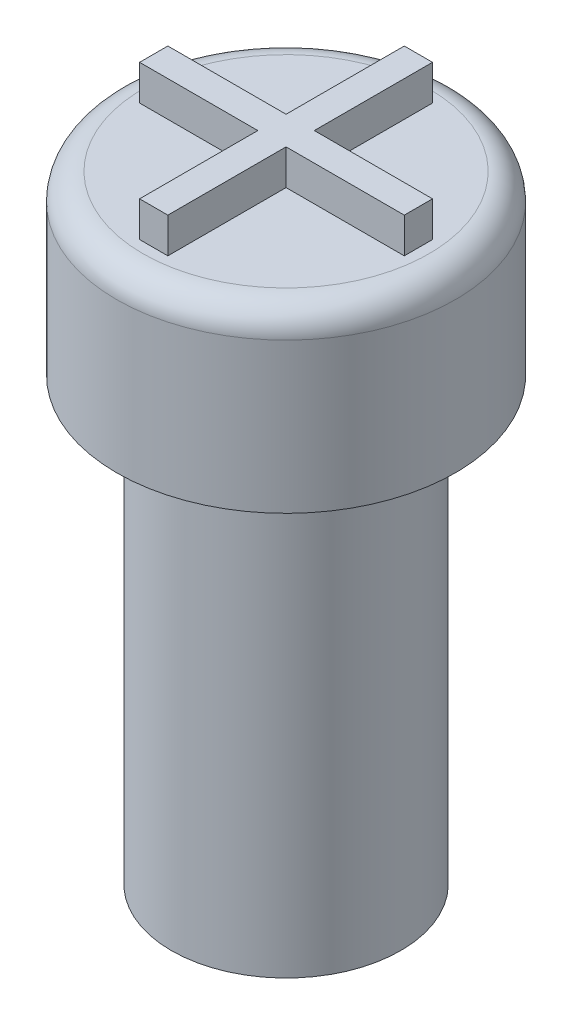
ISO-10303-21;
HEADER;
FILE_DESCRIPTION(('STEP AP214'),'2;1');
FILE_NAME('part.step','',(''),(''),'','','');
FILE_SCHEMA(('AUTOMOTIVE_DESIGN { 1 0 10303 214 1 1 1 1 }'));
ENDSEC;
DATA;
#1=APPLICATION_CONTEXT('core data for automotive mechanical design processes');
#2=APPLICATION_PROTOCOL_DEFINITION('international standard','automotive_design',2000,#1);
#3=PRODUCT_CONTEXT('',#1,'mechanical');
#4=PRODUCT('Part','Part','',(#3));
#5=PRODUCT_RELATED_PRODUCT_CATEGORY('part','',(#4));
#6=PRODUCT_DEFINITION_FORMATION('','',#4);
#7=PRODUCT_DEFINITION_CONTEXT('part definition',#1,'design');
#8=PRODUCT_DEFINITION('design','',#6,#7);
#9=PRODUCT_DEFINITION_SHAPE('','',#8);
#10=(LENGTH_UNIT() NAMED_UNIT(*) SI_UNIT(.MILLI.,.METRE.));
#11=(NAMED_UNIT(*) PLANE_ANGLE_UNIT() SI_UNIT($,.RADIAN.));
#12=(NAMED_UNIT(*) SI_UNIT($,.STERADIAN.) SOLID_ANGLE_UNIT());
#13=UNCERTAINTY_MEASURE_WITH_UNIT(LENGTH_MEASURE(1.E-05),#10,'distance_accuracy_value','');
#14=(GEOMETRIC_REPRESENTATION_CONTEXT(3) GLOBAL_UNCERTAINTY_ASSIGNED_CONTEXT((#13)) GLOBAL_UNIT_ASSIGNED_CONTEXT((#10,
#11,#12)) REPRESENTATION_CONTEXT('',''));
#15=CARTESIAN_POINT('',(0.,0.,0.));
#16=DIRECTION('',(0.,0.,1.));
#17=DIRECTION('',(1.,0.,0.));
#18=AXIS2_PLACEMENT_3D('',#15,#16,#17);
#19=CARTESIAN_POINT('',(0.,12.5,0.));
#20=DIRECTION('',(0.,-1.,0.));
#21=DIRECTION('',(0.,0.,-1.));
#22=AXIS2_PLACEMENT_3D('',#19,#20,#21);
#23=CYLINDRICAL_SURFACE('',#22,3.25);
#24=CARTESIAN_POINT('',(0.,12.5,0.));
#25=DIRECTION('',(0.,1.,0.));
#26=DIRECTION('',(0.,0.,1.));
#27=AXIS2_PLACEMENT_3D('',#24,#25,#26);
#28=CIRCLE('',#27,3.25);
#29=CARTESIAN_POINT('',(0.,12.5,3.25));
#30=VERTEX_POINT('',#29);
#31=EDGE_CURVE('E214',#30,#30,#28,.T.);
#32=ORIENTED_EDGE('',*,*,#31,.F.);
#33=EDGE_LOOP('',(#32));
#34=FACE_BOUND('',#33,.T.);
#35=CARTESIAN_POINT('',(0.,0.,0.));
#36=DIRECTION('',(0.,1.,0.));
#37=DIRECTION('',(0.,0.,1.));
#38=AXIS2_PLACEMENT_3D('',#35,#36,#37);
#39=CIRCLE('',#38,3.25);
#40=CARTESIAN_POINT('',(0.,0.,3.25));
#41=VERTEX_POINT('',#40);
#42=EDGE_CURVE('E210',#41,#41,#39,.T.);
#43=ORIENTED_EDGE('',*,*,#42,.T.);
#44=EDGE_LOOP('',(#43));
#45=FACE_BOUND('',#44,.T.);
#46=ADVANCED_FACE('F82',(#34,#45),#23,.T.);
#47=CARTESIAN_POINT('',(0.,0.,0.));
#48=DIRECTION('',(0.,1.,0.));
#49=DIRECTION('',(0.,0.,1.));
#50=AXIS2_PLACEMENT_3D('',#47,#48,#49);
#51=PLANE('',#50);
#52=CARTESIAN_POINT('',(0.,0.,0.));
#53=DIRECTION('',(0.,-1.,0.));
#54=DIRECTION('',(0.,0.,-1.));
#55=AXIS2_PLACEMENT_3D('',#52,#53,#54);
#56=CIRCLE('',#55,1.75);
#57=CARTESIAN_POINT('',(0.,0.,-1.75));
#58=VERTEX_POINT('',#57);
#59=EDGE_CURVE('E200',#58,#58,#56,.T.);
#60=ORIENTED_EDGE('',*,*,#59,.F.);
#61=EDGE_LOOP('',(#60));
#62=FACE_BOUND('',#61,.T.);
#63=ORIENTED_EDGE('',*,*,#42,.F.);
#64=EDGE_LOOP('',(#63));
#65=FACE_BOUND('',#64,.T.);
#66=ADVANCED_FACE('F236',(#62,#65),#51,.F.);
#67=CARTESIAN_POINT('',(0.,2.5,0.));
#68=DIRECTION('',(0.,-1.,0.));
#69=DIRECTION('',(0.,0.,-1.));
#70=AXIS2_PLACEMENT_3D('',#67,#68,#69);
#71=CYLINDRICAL_SURFACE('',#70,1.75);
#72=CARTESIAN_POINT('',(0.,2.5,0.));
#73=DIRECTION('',(0.,-1.,0.));
#74=DIRECTION('',(0.,0.,-1.));
#75=AXIS2_PLACEMENT_3D('',#72,#73,#74);
#76=CIRCLE('',#75,1.75);
#77=CARTESIAN_POINT('',(0.,2.5,-1.75));
#78=VERTEX_POINT('',#77);
#79=EDGE_CURVE('E206',#78,#78,#76,.T.);
#80=ORIENTED_EDGE('',*,*,#79,.F.);
#81=EDGE_LOOP('',(#80));
#82=FACE_BOUND('',#81,.T.);
#83=ORIENTED_EDGE('',*,*,#59,.T.);
#84=EDGE_LOOP('',(#83));
#85=FACE_BOUND('',#84,.T.);
#86=ADVANCED_FACE('F241',(#82,#85),#71,.F.);
#87=CARTESIAN_POINT('',(0.,2.5,0.));
#88=DIRECTION('',(0.,-1.,0.));
#89=DIRECTION('',(0.,0.,-1.));
#90=AXIS2_PLACEMENT_3D('',#87,#88,#89);
#91=PLANE('',#90);
#92=ORIENTED_EDGE('',*,*,#79,.T.);
#93=EDGE_LOOP('',(#92));
#94=FACE_BOUND('',#93,.T.);
#95=ADVANCED_FACE('F249',(#94),#91,.T.);
#96=CARTESIAN_POINT('',(0.,17.5,0.));
#97=DIRECTION('',(0.,-1.,0.));
#98=DIRECTION('',(0.,0.,-1.));
#99=AXIS2_PLACEMENT_3D('',#96,#97,#98);
#100=CYLINDRICAL_SURFACE('',#99,4.8);
#101=CARTESIAN_POINT('',(0.,16.75,0.));
#102=DIRECTION('',(0.,1.,0.));
#103=DIRECTION('',(0.,0.,1.));
#104=AXIS2_PLACEMENT_3D('',#101,#102,#103);
#105=CIRCLE('',#104,4.8);
#106=CARTESIAN_POINT('',(0.,16.75,4.8));
#107=VERTEX_POINT('',#106);
#108=EDGE_CURVE('E12',#107,#107,#105,.F.);
#109=ORIENTED_EDGE('',*,*,#108,.T.);
#110=EDGE_LOOP('',(#109));
#111=FACE_BOUND('',#110,.T.);
#112=CARTESIAN_POINT('',(0.,12.5,0.));
#113=DIRECTION('',(0.,1.,0.));
#114=DIRECTION('',(0.,0.,1.));
#115=AXIS2_PLACEMENT_3D('',#112,#113,#114);
#116=CIRCLE('',#115,4.8);
#117=CARTESIAN_POINT('',(0.,12.5,4.8));
#118=VERTEX_POINT('',#117);
#119=EDGE_CURVE('E195',#118,#118,#116,.T.);
#120=ORIENTED_EDGE('',*,*,#119,.T.);
#121=EDGE_LOOP('',(#120));
#122=FACE_BOUND('',#121,.T.);
#123=ADVANCED_FACE('F253',(#111,#122),#100,.T.);
#124=CARTESIAN_POINT('',(0.,17.5,0.));
#125=DIRECTION('',(0.,1.,0.));
#126=DIRECTION('',(0.,0.,1.));
#127=AXIS2_PLACEMENT_3D('',#124,#125,#126);
#128=PLANE('',#127);
#129=CARTESIAN_POINT('',(0.,17.5,0.));
#130=DIRECTION('',(0.,1.,0.));
#131=DIRECTION('',(0.,0.,1.));
#132=AXIS2_PLACEMENT_3D('',#129,#130,#131);
#133=CIRCLE('',#132,4.05);
#134=CARTESIAN_POINT('',(0.,17.5,4.05));
#135=VERTEX_POINT('',#134);
#136=EDGE_CURVE('E91',#135,#135,#133,.T.);
#137=ORIENTED_EDGE('',*,*,#136,.T.);
#138=EDGE_LOOP('',(#137));
#139=FACE_BOUND('',#138,.T.);
#140=DIRECTION('',(0.,0.,-1.));
#141=VECTOR('',#140,1.);
#142=CARTESIAN_POINT('',(0.4,17.5,-0.399999999999999));
#143=LINE('',#142,#141);
#144=CARTESIAN_POINT('',(0.4,17.5,-0.399999999999999));
#145=VERTEX_POINT('',#144);
#146=CARTESIAN_POINT('',(0.4,17.5,-3.75));
#147=VERTEX_POINT('',#146);
#148=EDGE_CURVE('E98',#145,#147,#143,.T.);
#149=ORIENTED_EDGE('',*,*,#148,.F.);
#150=DIRECTION('',(-1.,0.,0.));
#151=VECTOR('',#150,1.);
#152=CARTESIAN_POINT('',(3.75,17.5,-0.399999999999999));
#153=LINE('',#152,#151);
#154=CARTESIAN_POINT('',(3.75,17.5,-0.399999999999999));
#155=VERTEX_POINT('',#154);
#156=EDGE_CURVE('E102',#155,#145,#153,.T.);
#157=ORIENTED_EDGE('',*,*,#156,.F.);
#158=DIRECTION('',(0.,0.,-1.));
#159=VECTOR('',#158,1.);
#160=CARTESIAN_POINT('',(3.75,17.5,0.400000000000001));
#161=LINE('',#160,#159);
#162=CARTESIAN_POINT('',(3.75,17.5,0.400000000000001));
#163=VERTEX_POINT('',#162);
#164=EDGE_CURVE('E312',#163,#155,#161,.T.);
#165=ORIENTED_EDGE('',*,*,#164,.F.);
#166=DIRECTION('',(1.,0.,0.));
#167=VECTOR('',#166,1.);
#168=CARTESIAN_POINT('',(0.4,17.5,0.400000000000001));
#169=LINE('',#168,#167);
#170=CARTESIAN_POINT('',(0.4,17.5,0.400000000000001));
#171=VERTEX_POINT('',#170);
#172=EDGE_CURVE('E389',#171,#163,#169,.T.);
#173=ORIENTED_EDGE('',*,*,#172,.F.);
#174=DIRECTION('',(0.,0.,-1.));
#175=VECTOR('',#174,1.);
#176=CARTESIAN_POINT('',(0.4,17.5,3.75));
#177=LINE('',#176,#175);
#178=CARTESIAN_POINT('',(0.4,17.5,3.75));
#179=VERTEX_POINT('',#178);
#180=EDGE_CURVE('E385',#179,#171,#177,.T.);
#181=ORIENTED_EDGE('',*,*,#180,.F.);
#182=DIRECTION('',(1.,0.,0.));
#183=VECTOR('',#182,1.);
#184=CARTESIAN_POINT('',(-0.4,17.5,3.75));
#185=LINE('',#184,#183);
#186=CARTESIAN_POINT('',(-0.4,17.5,3.75));
#187=VERTEX_POINT('',#186);
#188=EDGE_CURVE('E381',#187,#179,#185,.T.);
#189=ORIENTED_EDGE('',*,*,#188,.F.);
#190=DIRECTION('',(0.,0.,1.));
#191=VECTOR('',#190,1.);
#192=CARTESIAN_POINT('',(-0.4,17.5,0.400000000000001));
#193=LINE('',#192,#191);
#194=CARTESIAN_POINT('',(-0.4,17.5,0.400000000000001));
#195=VERTEX_POINT('',#194);
#196=EDGE_CURVE('E377',#195,#187,#193,.T.);
#197=ORIENTED_EDGE('',*,*,#196,.F.);
#198=DIRECTION('',(1.,0.,0.));
#199=VECTOR('',#198,1.);
#200=CARTESIAN_POINT('',(-3.75,17.5,0.400000000000001));
#201=LINE('',#200,#199);
#202=CARTESIAN_POINT('',(-3.75,17.5,0.400000000000001));
#203=VERTEX_POINT('',#202);
#204=EDGE_CURVE('E373',#203,#195,#201,.T.);
#205=ORIENTED_EDGE('',*,*,#204,.F.);
#206=DIRECTION('',(0.,0.,1.));
#207=VECTOR('',#206,1.);
#208=CARTESIAN_POINT('',(-3.75,17.5,-0.399999999999999));
#209=LINE('',#208,#207);
#210=CARTESIAN_POINT('',(-3.75,17.5,-0.399999999999999));
#211=VERTEX_POINT('',#210);
#212=EDGE_CURVE('E365',#211,#203,#209,.T.);
#213=ORIENTED_EDGE('',*,*,#212,.F.);
#214=DIRECTION('',(-1.,0.,0.));
#215=VECTOR('',#214,1.);
#216=CARTESIAN_POINT('',(-0.4,17.5,-0.399999999999999));
#217=LINE('',#216,#215);
#218=CARTESIAN_POINT('',(-0.4,17.5,-0.399999999999999));
#219=VERTEX_POINT('',#218);
#220=EDGE_CURVE('E356',#219,#211,#217,.T.);
#221=ORIENTED_EDGE('',*,*,#220,.F.);
#222=DIRECTION('',(0.,0.,1.));
#223=VECTOR('',#222,1.);
#224=CARTESIAN_POINT('',(-0.4,17.5,-3.75));
#225=LINE('',#224,#223);
#226=CARTESIAN_POINT('',(-0.4,17.5,-3.75));
#227=VERTEX_POINT('',#226);
#228=EDGE_CURVE('E359',#227,#219,#225,.T.);
#229=ORIENTED_EDGE('',*,*,#228,.F.);
#230=DIRECTION('',(-1.,0.,0.));
#231=VECTOR('',#230,1.);
#232=CARTESIAN_POINT('',(0.4,17.5,-3.75));
#233=LINE('',#232,#231);
#234=EDGE_CURVE('E361',#147,#227,#233,.T.);
#235=ORIENTED_EDGE('',*,*,#234,.F.);
#236=EDGE_LOOP('',(#149,#157,#165,#173,#181,#189,#197,#205,#213,#221,#229,#235));
#237=FACE_BOUND('',#236,.T.);
#238=ADVANCED_FACE('F224',(#139,#237),#128,.T.);
#239=CARTESIAN_POINT('',(0.,12.5,0.));
#240=DIRECTION('',(0.,1.,0.));
#241=DIRECTION('',(0.,0.,1.));
#242=AXIS2_PLACEMENT_3D('',#239,#240,#241);
#243=PLANE('',#242);
#244=ORIENTED_EDGE('',*,*,#31,.T.);
#245=EDGE_LOOP('',(#244));
#246=FACE_BOUND('',#245,.T.);
#247=ORIENTED_EDGE('',*,*,#119,.F.);
#248=EDGE_LOOP('',(#247));
#249=FACE_BOUND('',#248,.T.);
#250=ADVANCED_FACE('F258',(#246,#249),#243,.F.);
#251=CARTESIAN_POINT('',(0.4,18.5,-0.399999999999999));
#252=DIRECTION('',(-1.,0.,0.));
#253=DIRECTION('',(0.,0.,1.));
#254=AXIS2_PLACEMENT_3D('',#251,#252,#253);
#255=PLANE('',#254);
#256=ORIENTED_EDGE('',*,*,#148,.T.);
#257=DIRECTION('',(0.,-1.,0.));
#258=VECTOR('',#257,1.);
#259=CARTESIAN_POINT('',(0.4,18.5,-3.75));
#260=LINE('',#259,#258);
#261=CARTESIAN_POINT('',(0.4,18.5,-3.75));
#262=VERTEX_POINT('',#261);
#263=EDGE_CURVE('E175',#262,#147,#260,.T.);
#264=ORIENTED_EDGE('',*,*,#263,.F.);
#265=DIRECTION('',(0.,0.,-1.));
#266=VECTOR('',#265,1.);
#267=CARTESIAN_POINT('',(0.4,18.5,-0.399999999999999));
#268=LINE('',#267,#266);
#269=CARTESIAN_POINT('',(0.4,18.5,-0.399999999999999));
#270=VERTEX_POINT('',#269);
#271=EDGE_CURVE('E182',#270,#262,#268,.T.);
#272=ORIENTED_EDGE('',*,*,#271,.F.);
#273=DIRECTION('',(0.,-1.,0.));
#274=VECTOR('',#273,1.);
#275=CARTESIAN_POINT('',(0.4,18.5,-0.399999999999999));
#276=LINE('',#275,#274);
#277=EDGE_CURVE('E308',#270,#145,#276,.T.);
#278=ORIENTED_EDGE('',*,*,#277,.T.);
#279=EDGE_LOOP('',(#256,#264,#272,#278));
#280=FACE_BOUND('',#279,.T.);
#281=ADVANCED_FACE('F193',(#280),#255,.F.);
#282=CARTESIAN_POINT('',(0.4,18.5,-3.75));
#283=DIRECTION('',(0.,0.,1.));
#284=DIRECTION('',(1.,0.,0.));
#285=AXIS2_PLACEMENT_3D('',#282,#283,#284);
#286=PLANE('',#285);
#287=ORIENTED_EDGE('',*,*,#234,.T.);
#288=DIRECTION('',(0.,-1.,0.));
#289=VECTOR('',#288,1.);
#290=CARTESIAN_POINT('',(-0.4,18.5,-3.75));
#291=LINE('',#290,#289);
#292=CARTESIAN_POINT('',(-0.4,18.5,-3.75));
#293=VERTEX_POINT('',#292);
#294=EDGE_CURVE('E177',#293,#227,#291,.T.);
#295=ORIENTED_EDGE('',*,*,#294,.F.);
#296=DIRECTION('',(-1.,0.,0.));
#297=VECTOR('',#296,1.);
#298=CARTESIAN_POINT('',(0.4,18.5,-3.75));
#299=LINE('',#298,#297);
#300=EDGE_CURVE('E170',#262,#293,#299,.T.);
#301=ORIENTED_EDGE('',*,*,#300,.F.);
#302=ORIENTED_EDGE('',*,*,#263,.T.);
#303=EDGE_LOOP('',(#287,#295,#301,#302));
#304=FACE_BOUND('',#303,.T.);
#305=ADVANCED_FACE('F173',(#304),#286,.F.);
#306=CARTESIAN_POINT('',(-0.4,18.5,-3.75));
#307=DIRECTION('',(1.,0.,0.));
#308=DIRECTION('',(0.,0.,-1.));
#309=AXIS2_PLACEMENT_3D('',#306,#307,#308);
#310=PLANE('',#309);
#311=ORIENTED_EDGE('',*,*,#228,.T.);
#312=DIRECTION('',(0.,-1.,0.));
#313=VECTOR('',#312,1.);
#314=CARTESIAN_POINT('',(-0.4,18.5,-0.399999999999999));
#315=LINE('',#314,#313);
#316=CARTESIAN_POINT('',(-0.4,18.5,-0.399999999999999));
#317=VERTEX_POINT('',#316);
#318=EDGE_CURVE('E202',#317,#219,#315,.T.);
#319=ORIENTED_EDGE('',*,*,#318,.F.);
#320=DIRECTION('',(0.,0.,1.));
#321=VECTOR('',#320,1.);
#322=CARTESIAN_POINT('',(-0.4,18.5,-3.75));
#323=LINE('',#322,#321);
#324=EDGE_CURVE('E181',#293,#317,#323,.T.);
#325=ORIENTED_EDGE('',*,*,#324,.F.);
#326=ORIENTED_EDGE('',*,*,#294,.T.);
#327=EDGE_LOOP('',(#311,#319,#325,#326));
#328=FACE_BOUND('',#327,.T.);
#329=ADVANCED_FACE('F267',(#328),#310,.F.);
#330=CARTESIAN_POINT('',(-0.4,18.5,-0.399999999999999));
#331=DIRECTION('',(0.,0.,1.));
#332=DIRECTION('',(1.,0.,0.));
#333=AXIS2_PLACEMENT_3D('',#330,#331,#332);
#334=PLANE('',#333);
#335=ORIENTED_EDGE('',*,*,#220,.T.);
#336=DIRECTION('',(0.,-1.,0.));
#337=VECTOR('',#336,1.);
#338=CARTESIAN_POINT('',(-3.75,18.5,-0.399999999999999));
#339=LINE('',#338,#337);
#340=CARTESIAN_POINT('',(-3.75,18.5,-0.399999999999999));
#341=VERTEX_POINT('',#340);
#342=EDGE_CURVE('E347',#341,#211,#339,.T.);
#343=ORIENTED_EDGE('',*,*,#342,.F.);
#344=DIRECTION('',(-1.,0.,0.));
#345=VECTOR('',#344,1.);
#346=CARTESIAN_POINT('',(-0.4,18.5,-0.399999999999999));
#347=LINE('',#346,#345);
#348=EDGE_CURVE('E357',#317,#341,#347,.T.);
#349=ORIENTED_EDGE('',*,*,#348,.F.);
#350=ORIENTED_EDGE('',*,*,#318,.T.);
#351=EDGE_LOOP('',(#335,#343,#349,#350));
#352=FACE_BOUND('',#351,.T.);
#353=ADVANCED_FACE('F270',(#352),#334,.F.);
#354=CARTESIAN_POINT('',(-3.75,18.5,-0.399999999999999));
#355=DIRECTION('',(1.,0.,0.));
#356=DIRECTION('',(0.,0.,-1.));
#357=AXIS2_PLACEMENT_3D('',#354,#355,#356);
#358=PLANE('',#357);
#359=ORIENTED_EDGE('',*,*,#212,.T.);
#360=DIRECTION('',(0.,-1.,0.));
#361=VECTOR('',#360,1.);
#362=CARTESIAN_POINT('',(-3.75,18.5,0.400000000000001));
#363=LINE('',#362,#361);
#364=CARTESIAN_POINT('',(-3.75,18.5,0.400000000000001));
#365=VERTEX_POINT('',#364);
#366=EDGE_CURVE('E343',#365,#203,#363,.T.);
#367=ORIENTED_EDGE('',*,*,#366,.F.);
#368=DIRECTION('',(0.,0.,1.));
#369=VECTOR('',#368,1.);
#370=CARTESIAN_POINT('',(-3.75,18.5,-0.399999999999999));
#371=LINE('',#370,#369);
#372=EDGE_CURVE('E411',#341,#365,#371,.T.);
#373=ORIENTED_EDGE('',*,*,#372,.F.);
#374=ORIENTED_EDGE('',*,*,#342,.T.);
#375=EDGE_LOOP('',(#359,#367,#373,#374));
#376=FACE_BOUND('',#375,.T.);
#377=ADVANCED_FACE('F274',(#376),#358,.F.);
#378=CARTESIAN_POINT('',(-3.75,18.5,0.400000000000001));
#379=DIRECTION('',(0.,0.,-1.));
#380=DIRECTION('',(-1.,0.,0.));
#381=AXIS2_PLACEMENT_3D('',#378,#379,#380);
#382=PLANE('',#381);
#383=ORIENTED_EDGE('',*,*,#204,.T.);
#384=DIRECTION('',(0.,-1.,0.));
#385=VECTOR('',#384,1.);
#386=CARTESIAN_POINT('',(-0.4,18.5,0.400000000000001));
#387=LINE('',#386,#385);
#388=CARTESIAN_POINT('',(-0.4,18.5,0.400000000000001));
#389=VERTEX_POINT('',#388);
#390=EDGE_CURVE('E339',#389,#195,#387,.T.);
#391=ORIENTED_EDGE('',*,*,#390,.F.);
#392=DIRECTION('',(1.,0.,0.));
#393=VECTOR('',#392,1.);
#394=CARTESIAN_POINT('',(-3.75,18.5,0.400000000000001));
#395=LINE('',#394,#393);
#396=EDGE_CURVE('E409',#365,#389,#395,.T.);
#397=ORIENTED_EDGE('',*,*,#396,.F.);
#398=ORIENTED_EDGE('',*,*,#366,.T.);
#399=EDGE_LOOP('',(#383,#391,#397,#398));
#400=FACE_BOUND('',#399,.T.);
#401=ADVANCED_FACE('F278',(#400),#382,.F.);
#402=CARTESIAN_POINT('',(-0.4,18.5,0.400000000000001));
#403=DIRECTION('',(1.,0.,0.));
#404=DIRECTION('',(0.,0.,-1.));
#405=AXIS2_PLACEMENT_3D('',#402,#403,#404);
#406=PLANE('',#405);
#407=ORIENTED_EDGE('',*,*,#196,.T.);
#408=DIRECTION('',(0.,-1.,0.));
#409=VECTOR('',#408,1.);
#410=CARTESIAN_POINT('',(-0.4,18.5,3.75));
#411=LINE('',#410,#409);
#412=CARTESIAN_POINT('',(-0.4,18.5,3.75));
#413=VERTEX_POINT('',#412);
#414=EDGE_CURVE('E335',#413,#187,#411,.T.);
#415=ORIENTED_EDGE('',*,*,#414,.F.);
#416=DIRECTION('',(0.,0.,1.));
#417=VECTOR('',#416,1.);
#418=CARTESIAN_POINT('',(-0.4,18.5,0.400000000000001));
#419=LINE('',#418,#417);
#420=EDGE_CURVE('E405',#389,#413,#419,.T.);
#421=ORIENTED_EDGE('',*,*,#420,.F.);
#422=ORIENTED_EDGE('',*,*,#390,.T.);
#423=EDGE_LOOP('',(#407,#415,#421,#422));
#424=FACE_BOUND('',#423,.T.);
#425=ADVANCED_FACE('F282',(#424),#406,.F.);
#426=CARTESIAN_POINT('',(-0.4,18.5,3.75));
#427=DIRECTION('',(0.,0.,-1.));
#428=DIRECTION('',(-1.,0.,0.));
#429=AXIS2_PLACEMENT_3D('',#426,#427,#428);
#430=PLANE('',#429);
#431=ORIENTED_EDGE('',*,*,#188,.T.);
#432=DIRECTION('',(0.,-1.,0.));
#433=VECTOR('',#432,1.);
#434=CARTESIAN_POINT('',(0.4,18.5,3.75));
#435=LINE('',#434,#433);
#436=CARTESIAN_POINT('',(0.4,18.5,3.75));
#437=VERTEX_POINT('',#436);
#438=EDGE_CURVE('E331',#437,#179,#435,.T.);
#439=ORIENTED_EDGE('',*,*,#438,.F.);
#440=DIRECTION('',(1.,0.,0.));
#441=VECTOR('',#440,1.);
#442=CARTESIAN_POINT('',(-0.4,18.5,3.75));
#443=LINE('',#442,#441);
#444=EDGE_CURVE('E403',#413,#437,#443,.T.);
#445=ORIENTED_EDGE('',*,*,#444,.F.);
#446=ORIENTED_EDGE('',*,*,#414,.T.);
#447=EDGE_LOOP('',(#431,#439,#445,#446));
#448=FACE_BOUND('',#447,.T.);
#449=ADVANCED_FACE('F286',(#448),#430,.F.);
#450=CARTESIAN_POINT('',(0.4,18.5,3.75));
#451=DIRECTION('',(-1.,0.,0.));
#452=DIRECTION('',(0.,0.,1.));
#453=AXIS2_PLACEMENT_3D('',#450,#451,#452);
#454=PLANE('',#453);
#455=ORIENTED_EDGE('',*,*,#180,.T.);
#456=DIRECTION('',(0.,-1.,0.));
#457=VECTOR('',#456,1.);
#458=CARTESIAN_POINT('',(0.4,18.5,0.400000000000001));
#459=LINE('',#458,#457);
#460=CARTESIAN_POINT('',(0.4,18.5,0.400000000000001));
#461=VERTEX_POINT('',#460);
#462=EDGE_CURVE('E327',#461,#171,#459,.T.);
#463=ORIENTED_EDGE('',*,*,#462,.F.);
#464=DIRECTION('',(0.,0.,-1.));
#465=VECTOR('',#464,1.);
#466=CARTESIAN_POINT('',(0.4,18.5,3.75));
#467=LINE('',#466,#465);
#468=EDGE_CURVE('E399',#437,#461,#467,.T.);
#469=ORIENTED_EDGE('',*,*,#468,.F.);
#470=ORIENTED_EDGE('',*,*,#438,.T.);
#471=EDGE_LOOP('',(#455,#463,#469,#470));
#472=FACE_BOUND('',#471,.T.);
#473=ADVANCED_FACE('F290',(#472),#454,.F.);
#474=CARTESIAN_POINT('',(0.4,18.5,0.400000000000001));
#475=DIRECTION('',(0.,0.,-1.));
#476=DIRECTION('',(-1.,0.,0.));
#477=AXIS2_PLACEMENT_3D('',#474,#475,#476);
#478=PLANE('',#477);
#479=ORIENTED_EDGE('',*,*,#172,.T.);
#480=DIRECTION('',(0.,-1.,0.));
#481=VECTOR('',#480,1.);
#482=CARTESIAN_POINT('',(3.75,18.5,0.400000000000001));
#483=LINE('',#482,#481);
#484=CARTESIAN_POINT('',(3.75,18.5,0.400000000000001));
#485=VERTEX_POINT('',#484);
#486=EDGE_CURVE('E318',#485,#163,#483,.T.);
#487=ORIENTED_EDGE('',*,*,#486,.F.);
#488=DIRECTION('',(1.,0.,0.));
#489=VECTOR('',#488,1.);
#490=CARTESIAN_POINT('',(0.4,18.5,0.400000000000001));
#491=LINE('',#490,#489);
#492=EDGE_CURVE('E397',#461,#485,#491,.T.);
#493=ORIENTED_EDGE('',*,*,#492,.F.);
#494=ORIENTED_EDGE('',*,*,#462,.T.);
#495=EDGE_LOOP('',(#479,#487,#493,#494));
#496=FACE_BOUND('',#495,.T.);
#497=ADVANCED_FACE('F294',(#496),#478,.F.);
#498=CARTESIAN_POINT('',(3.75,18.5,0.400000000000001));
#499=DIRECTION('',(-1.,0.,0.));
#500=DIRECTION('',(0.,0.,1.));
#501=AXIS2_PLACEMENT_3D('',#498,#499,#500);
#502=PLANE('',#501);
#503=ORIENTED_EDGE('',*,*,#164,.T.);
#504=DIRECTION('',(0.,-1.,0.));
#505=VECTOR('',#504,1.);
#506=CARTESIAN_POINT('',(3.75,18.5,-0.399999999999999));
#507=LINE('',#506,#505);
#508=CARTESIAN_POINT('',(3.75,18.5,-0.399999999999999));
#509=VERTEX_POINT('',#508);
#510=EDGE_CURVE('E310',#509,#155,#507,.T.);
#511=ORIENTED_EDGE('',*,*,#510,.F.);
#512=DIRECTION('',(0.,0.,-1.));
#513=VECTOR('',#512,1.);
#514=CARTESIAN_POINT('',(3.75,18.5,0.400000000000001));
#515=LINE('',#514,#513);
#516=EDGE_CURVE('E320',#485,#509,#515,.T.);
#517=ORIENTED_EDGE('',*,*,#516,.F.);
#518=ORIENTED_EDGE('',*,*,#486,.T.);
#519=EDGE_LOOP('',(#503,#511,#517,#518));
#520=FACE_BOUND('',#519,.T.);
#521=ADVANCED_FACE('F298',(#520),#502,.F.);
#522=CARTESIAN_POINT('',(3.75,18.5,-0.399999999999999));
#523=DIRECTION('',(0.,0.,1.));
#524=DIRECTION('',(1.,0.,0.));
#525=AXIS2_PLACEMENT_3D('',#522,#523,#524);
#526=PLANE('',#525);
#527=ORIENTED_EDGE('',*,*,#156,.T.);
#528=ORIENTED_EDGE('',*,*,#277,.F.);
#529=DIRECTION('',(-1.,0.,0.));
#530=VECTOR('',#529,1.);
#531=CARTESIAN_POINT('',(3.75,18.5,-0.399999999999999));
#532=LINE('',#531,#530);
#533=EDGE_CURVE('E187',#509,#270,#532,.T.);
#534=ORIENTED_EDGE('',*,*,#533,.F.);
#535=ORIENTED_EDGE('',*,*,#510,.T.);
#536=EDGE_LOOP('',(#527,#528,#534,#535));
#537=FACE_BOUND('',#536,.T.);
#538=ADVANCED_FACE('F232',(#537),#526,.F.);
#539=CARTESIAN_POINT('',(0.,18.5,0.));
#540=DIRECTION('',(0.,1.,0.));
#541=DIRECTION('',(0.,0.,1.));
#542=AXIS2_PLACEMENT_3D('',#539,#540,#541);
#543=PLANE('',#542);
#544=ORIENTED_EDGE('',*,*,#271,.T.);
#545=ORIENTED_EDGE('',*,*,#300,.T.);
#546=ORIENTED_EDGE('',*,*,#324,.T.);
#547=ORIENTED_EDGE('',*,*,#348,.T.);
#548=ORIENTED_EDGE('',*,*,#372,.T.);
#549=ORIENTED_EDGE('',*,*,#396,.T.);
#550=ORIENTED_EDGE('',*,*,#420,.T.);
#551=ORIENTED_EDGE('',*,*,#444,.T.);
#552=ORIENTED_EDGE('',*,*,#468,.T.);
#553=ORIENTED_EDGE('',*,*,#492,.T.);
#554=ORIENTED_EDGE('',*,*,#516,.T.);
#555=ORIENTED_EDGE('',*,*,#533,.T.);
#556=EDGE_LOOP('',(#544,#545,#546,#547,#548,#549,#550,#551,#552,#553,#554,#555));
#557=FACE_BOUND('',#556,.T.);
#558=ADVANCED_FACE('F185',(#557),#543,.T.);
#559=CARTESIAN_POINT('',(0.,16.75,0.));
#560=DIRECTION('',(0.,1.,0.));
#561=DIRECTION('',(0.,0.,1.));
#562=AXIS2_PLACEMENT_3D('',#559,#560,#561);
#563=TOROIDAL_SURFACE('',#562,4.05,0.75);
#564=ORIENTED_EDGE('',*,*,#108,.F.);
#565=EDGE_LOOP('',(#564));
#566=FACE_BOUND('',#565,.T.);
#567=ORIENTED_EDGE('',*,*,#136,.F.);
#568=EDGE_LOOP('',(#567));
#569=FACE_BOUND('',#568,.T.);
#570=ADVANCED_FACE('F84',(#566,#569),#563,.T.);
#571=CLOSED_SHELL('',(#46,#66,#86,#95,#123,#238,#250,#281,#305,#329,#353,#377,#401,#425,#449,
#473,#497,#521,#538,#558,#570));
#572=MANIFOLD_SOLID_BREP('B2',#571);
#573=ADVANCED_BREP_SHAPE_REPRESENTATION('',(#18,#572),#14);
#574=SHAPE_DEFINITION_REPRESENTATION(#9,#573);
ENDSEC;
END-ISO-10303-21;
